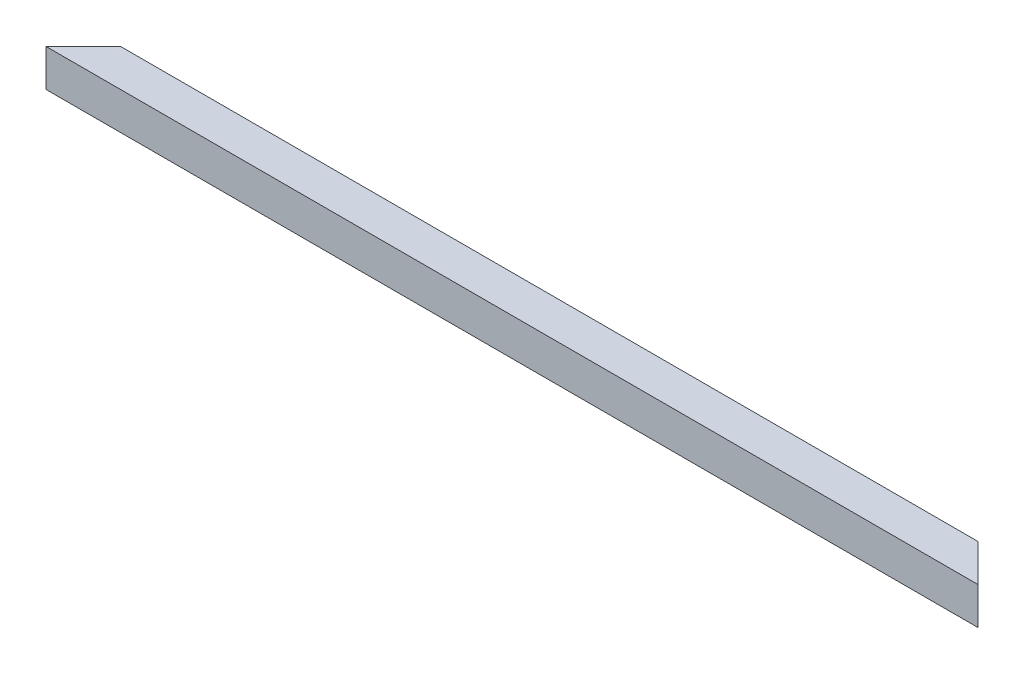
ISO-10303-21;
HEADER;
FILE_DESCRIPTION(('STEP AP214'),'2;1');
FILE_NAME('part.step','',(''),(''),'','','');
FILE_SCHEMA(('AUTOMOTIVE_DESIGN { 1 0 10303 214 1 1 1 1 }'));
ENDSEC;
DATA;
#1=APPLICATION_CONTEXT('core data for automotive mechanical design processes');
#2=APPLICATION_PROTOCOL_DEFINITION('international standard','automotive_design',2000,#1);
#3=PRODUCT_CONTEXT('',#1,'mechanical');
#4=PRODUCT('Part','Part','',(#3));
#5=PRODUCT_RELATED_PRODUCT_CATEGORY('part','',(#4));
#6=PRODUCT_DEFINITION_FORMATION('','',#4);
#7=PRODUCT_DEFINITION_CONTEXT('part definition',#1,'design');
#8=PRODUCT_DEFINITION('design','',#6,#7);
#9=PRODUCT_DEFINITION_SHAPE('','',#8);
#10=(LENGTH_UNIT() NAMED_UNIT(*) SI_UNIT(.MILLI.,.METRE.));
#11=(NAMED_UNIT(*) PLANE_ANGLE_UNIT() SI_UNIT($,.RADIAN.));
#12=(NAMED_UNIT(*) SI_UNIT($,.STERADIAN.) SOLID_ANGLE_UNIT());
#13=UNCERTAINTY_MEASURE_WITH_UNIT(LENGTH_MEASURE(1.E-05),#10,'distance_accuracy_value','');
#14=(GEOMETRIC_REPRESENTATION_CONTEXT(3) GLOBAL_UNCERTAINTY_ASSIGNED_CONTEXT((#13)) GLOBAL_UNIT_ASSIGNED_CONTEXT((#10,
#11,#12)) REPRESENTATION_CONTEXT('',''));
#15=CARTESIAN_POINT('',(0.,0.,0.));
#16=DIRECTION('',(0.,0.,1.));
#17=DIRECTION('',(1.,0.,0.));
#18=AXIS2_PLACEMENT_3D('',#15,#16,#17);
#19=CARTESIAN_POINT('',(1000.,-20.,-20.));
#20=DIRECTION('',(0.,0.,1.));
#21=DIRECTION('',(1.,0.,0.));
#22=AXIS2_PLACEMENT_3D('',#19,#20,#21);
#23=PLANE('',#22);
#24=DIRECTION('',(-1.,0.,0.));
#25=VECTOR('',#24,1.);
#26=CARTESIAN_POINT('',(1000.,20.,-20.));
#27=LINE('',#26,#25);
#28=CARTESIAN_POINT('',(960.,20.,-20.));
#29=VERTEX_POINT('',#28);
#30=CARTESIAN_POINT('',(40.,20.,-20.));
#31=VERTEX_POINT('',#30);
#32=EDGE_CURVE('E108',#29,#31,#27,.T.);
#33=ORIENTED_EDGE('',*,*,#32,.F.);
#34=DIRECTION('',(0.,1.,0.));
#35=VECTOR('',#34,1.);
#36=CARTESIAN_POINT('',(960.,-20.,-20.));
#37=LINE('',#36,#35);
#38=CARTESIAN_POINT('',(960.,-20.,-20.));
#39=VERTEX_POINT('',#38);
#40=EDGE_CURVE('E98',#39,#29,#37,.T.);
#41=ORIENTED_EDGE('',*,*,#40,.F.);
#42=DIRECTION('',(-1.,0.,0.));
#43=VECTOR('',#42,1.);
#44=CARTESIAN_POINT('',(1000.,-20.,-20.));
#45=LINE('',#44,#43);
#46=CARTESIAN_POINT('',(40.0000000000001,-20.,-20.));
#47=VERTEX_POINT('',#46);
#48=EDGE_CURVE('E53',#39,#47,#45,.T.);
#49=ORIENTED_EDGE('',*,*,#48,.T.);
#50=DIRECTION('',(0.,1.,0.));
#51=VECTOR('',#50,1.);
#52=CARTESIAN_POINT('',(40.,-20.,-20.));
#53=LINE('',#52,#51);
#54=EDGE_CURVE('E165',#47,#31,#53,.T.);
#55=ORIENTED_EDGE('',*,*,#54,.T.);
#56=EDGE_LOOP('',(#33,#41,#49,#55));
#57=FACE_BOUND('',#56,.T.);
#58=ADVANCED_FACE('F32',(#57),#23,.F.);
#59=CARTESIAN_POINT('',(1000.,20.,20.));
#60=DIRECTION('',(0.,-1.,0.));
#61=DIRECTION('',(0.,0.,-1.));
#62=AXIS2_PLACEMENT_3D('',#59,#60,#61);
#63=PLANE('',#62);
#64=DIRECTION('',(-1.,0.,0.));
#65=VECTOR('',#64,1.);
#66=CARTESIAN_POINT('',(1000.,20.,20.));
#67=LINE('',#66,#65);
#68=CARTESIAN_POINT('',(1000.,20.,20.));
#69=VERTEX_POINT('',#68);
#70=CARTESIAN_POINT('',(0.,20.,20.));
#71=VERTEX_POINT('',#70);
#72=EDGE_CURVE('E116',#69,#71,#67,.T.);
#73=ORIENTED_EDGE('',*,*,#72,.F.);
#74=DIRECTION('',(0.707106781186547,0.,0.707106781186548));
#75=VECTOR('',#74,1.);
#76=CARTESIAN_POINT('',(1000.,20.,20.));
#77=LINE('',#76,#75);
#78=EDGE_CURVE('E105',#29,#69,#77,.T.);
#79=ORIENTED_EDGE('',*,*,#78,.F.);
#80=ORIENTED_EDGE('',*,*,#32,.T.);
#81=DIRECTION('',(0.707106781186548,0.,-0.707106781186548));
#82=VECTOR('',#81,1.);
#83=CARTESIAN_POINT('',(0.,20.,20.));
#84=LINE('',#83,#82);
#85=EDGE_CURVE('E161',#71,#31,#84,.T.);
#86=ORIENTED_EDGE('',*,*,#85,.F.);
#87=EDGE_LOOP('',(#73,#79,#80,#86));
#88=FACE_BOUND('',#87,.T.);
#89=ADVANCED_FACE('F163',(#88),#63,.F.);
#90=CARTESIAN_POINT('',(1000.,-20.,20.));
#91=DIRECTION('',(0.,0.,-1.));
#92=DIRECTION('',(-1.,0.,0.));
#93=AXIS2_PLACEMENT_3D('',#90,#91,#92);
#94=PLANE('',#93);
#95=DIRECTION('',(0.,-1.,0.));
#96=VECTOR('',#95,1.);
#97=CARTESIAN_POINT('',(0.,-20.,20.));
#98=LINE('',#97,#96);
#99=CARTESIAN_POINT('',(0.,-20.,20.));
#100=VERTEX_POINT('',#99);
#101=EDGE_CURVE('E118',#71,#100,#98,.T.);
#102=ORIENTED_EDGE('',*,*,#101,.T.);
#103=DIRECTION('',(-1.,0.,0.));
#104=VECTOR('',#103,1.);
#105=CARTESIAN_POINT('',(1000.,-20.,20.));
#106=LINE('',#105,#104);
#107=CARTESIAN_POINT('',(1000.,-20.,20.));
#108=VERTEX_POINT('',#107);
#109=EDGE_CURVE('E114',#108,#100,#106,.T.);
#110=ORIENTED_EDGE('',*,*,#109,.F.);
#111=DIRECTION('',(0.,-1.,0.));
#112=VECTOR('',#111,1.);
#113=CARTESIAN_POINT('',(1000.,-20.,20.));
#114=LINE('',#113,#112);
#115=EDGE_CURVE('E101',#69,#108,#114,.T.);
#116=ORIENTED_EDGE('',*,*,#115,.F.);
#117=ORIENTED_EDGE('',*,*,#72,.T.);
#118=EDGE_LOOP('',(#102,#110,#116,#117));
#119=FACE_BOUND('',#118,.T.);
#120=ADVANCED_FACE('F157',(#119),#94,.F.);
#121=CARTESIAN_POINT('',(1000.,-20.,20.));
#122=DIRECTION('',(0.,1.,0.));
#123=DIRECTION('',(0.,0.,1.));
#124=AXIS2_PLACEMENT_3D('',#121,#122,#123);
#125=PLANE('',#124);
#126=ORIENTED_EDGE('',*,*,#48,.F.);
#127=DIRECTION('',(0.707106781186547,0.,0.707106781186548));
#128=VECTOR('',#127,1.);
#129=CARTESIAN_POINT('',(1000.,-20.,20.));
#130=LINE('',#129,#128);
#131=EDGE_CURVE('E96',#39,#108,#130,.T.);
#132=ORIENTED_EDGE('',*,*,#131,.T.);
#133=ORIENTED_EDGE('',*,*,#109,.T.);
#134=DIRECTION('',(0.707106781186548,0.,-0.707106781186548));
#135=VECTOR('',#134,1.);
#136=CARTESIAN_POINT('',(0.,-20.,20.));
#137=LINE('',#136,#135);
#138=EDGE_CURVE('E113',#100,#47,#137,.T.);
#139=ORIENTED_EDGE('',*,*,#138,.T.);
#140=EDGE_LOOP('',(#126,#132,#133,#139));
#141=FACE_BOUND('',#140,.T.);
#142=ADVANCED_FACE('F112',(#141),#125,.F.);
#143=CARTESIAN_POINT('',(1000.,-18.,18.));
#144=DIRECTION('',(0.,0.,-1.));
#145=DIRECTION('',(-1.,0.,0.));
#146=AXIS2_PLACEMENT_3D('',#143,#144,#145);
#147=PLANE('',#146);
#148=DIRECTION('',(0.,1.,0.));
#149=VECTOR('',#148,1.);
#150=CARTESIAN_POINT('',(998.,-18.,18.));
#151=LINE('',#150,#149);
#152=CARTESIAN_POINT('',(998.,-18.,18.));
#153=VERTEX_POINT('',#152);
#154=CARTESIAN_POINT('',(998.,18.,18.));
#155=VERTEX_POINT('',#154);
#156=EDGE_CURVE('E45',#153,#155,#151,.T.);
#157=ORIENTED_EDGE('',*,*,#156,.F.);
#158=DIRECTION('',(-1.,0.,0.));
#159=VECTOR('',#158,1.);
#160=CARTESIAN_POINT('',(1000.,-18.,18.));
#161=LINE('',#160,#159);
#162=CARTESIAN_POINT('',(1.99999999999989,-18.,18.));
#163=VERTEX_POINT('',#162);
#164=EDGE_CURVE('E144',#153,#163,#161,.T.);
#165=ORIENTED_EDGE('',*,*,#164,.T.);
#166=DIRECTION('',(0.,-1.,0.));
#167=VECTOR('',#166,1.);
#168=CARTESIAN_POINT('',(2.00000000000011,-18.,18.));
#169=LINE('',#168,#167);
#170=CARTESIAN_POINT('',(1.99999999999989,18.,18.));
#171=VERTEX_POINT('',#170);
#172=EDGE_CURVE('E133',#171,#163,#169,.T.);
#173=ORIENTED_EDGE('',*,*,#172,.F.);
#174=DIRECTION('',(-1.,0.,0.));
#175=VECTOR('',#174,1.);
#176=CARTESIAN_POINT('',(1000.,18.,18.));
#177=LINE('',#176,#175);
#178=EDGE_CURVE('E142',#155,#171,#177,.T.);
#179=ORIENTED_EDGE('',*,*,#178,.F.);
#180=EDGE_LOOP('',(#157,#165,#173,#179));
#181=FACE_BOUND('',#180,.T.);
#182=ADVANCED_FACE('F141',(#181),#147,.T.);
#183=CARTESIAN_POINT('',(1000.,-18.,-18.));
#184=DIRECTION('',(0.,1.,0.));
#185=DIRECTION('',(0.,0.,1.));
#186=AXIS2_PLACEMENT_3D('',#183,#184,#185);
#187=PLANE('',#186);
#188=DIRECTION('',(0.707106781186547,0.,0.707106781186548));
#189=VECTOR('',#188,1.);
#190=CARTESIAN_POINT('',(981.,-18.,0.999999999999959));
#191=LINE('',#190,#189);
#192=CARTESIAN_POINT('',(962.,-18.,-18.));
#193=VERTEX_POINT('',#192);
#194=EDGE_CURVE('E167',#193,#153,#191,.T.);
#195=ORIENTED_EDGE('',*,*,#194,.F.);
#196=DIRECTION('',(-1.,0.,0.));
#197=VECTOR('',#196,1.);
#198=CARTESIAN_POINT('',(1000.,-18.,-18.));
#199=LINE('',#198,#197);
#200=CARTESIAN_POINT('',(37.9999999999999,-18.,-18.));
#201=VERTEX_POINT('',#200);
#202=EDGE_CURVE('E153',#193,#201,#199,.T.);
#203=ORIENTED_EDGE('',*,*,#202,.T.);
#204=DIRECTION('',(0.707106781186548,0.,-0.707106781186548));
#205=VECTOR('',#204,1.);
#206=CARTESIAN_POINT('',(519.,-18.,-499.));
#207=LINE('',#206,#205);
#208=EDGE_CURVE('E145',#163,#201,#207,.T.);
#209=ORIENTED_EDGE('',*,*,#208,.F.);
#210=ORIENTED_EDGE('',*,*,#164,.F.);
#211=EDGE_LOOP('',(#195,#203,#209,#210));
#212=FACE_BOUND('',#211,.T.);
#213=ADVANCED_FACE('F178',(#212),#187,.T.);
#214=CARTESIAN_POINT('',(1000.,-18.,-18.));
#215=DIRECTION('',(0.,0.,1.));
#216=DIRECTION('',(1.,0.,0.));
#217=AXIS2_PLACEMENT_3D('',#214,#215,#216);
#218=PLANE('',#217);
#219=DIRECTION('',(0.,-1.,0.));
#220=VECTOR('',#219,1.);
#221=CARTESIAN_POINT('',(962.,-18.,-18.));
#222=LINE('',#221,#220);
#223=CARTESIAN_POINT('',(962.,18.,-18.));
#224=VERTEX_POINT('',#223);
#225=EDGE_CURVE('E109',#224,#193,#222,.T.);
#226=ORIENTED_EDGE('',*,*,#225,.F.);
#227=DIRECTION('',(-1.,0.,0.));
#228=VECTOR('',#227,1.);
#229=CARTESIAN_POINT('',(1000.,18.,-18.));
#230=LINE('',#229,#228);
#231=CARTESIAN_POINT('',(38.0000000000001,18.,-18.0000000000001));
#232=VERTEX_POINT('',#231);
#233=EDGE_CURVE('E147',#224,#232,#230,.T.);
#234=ORIENTED_EDGE('',*,*,#233,.T.);
#235=DIRECTION('',(0.,1.,0.));
#236=VECTOR('',#235,1.);
#237=CARTESIAN_POINT('',(37.9999999999999,-18.,-18.));
#238=LINE('',#237,#236);
#239=EDGE_CURVE('E136',#201,#232,#238,.T.);
#240=ORIENTED_EDGE('',*,*,#239,.F.);
#241=ORIENTED_EDGE('',*,*,#202,.F.);
#242=EDGE_LOOP('',(#226,#234,#240,#241));
#243=FACE_BOUND('',#242,.T.);
#244=ADVANCED_FACE('F179',(#243),#218,.T.);
#245=CARTESIAN_POINT('',(1000.,18.,-18.));
#246=DIRECTION('',(0.,-1.,0.));
#247=DIRECTION('',(0.,0.,-1.));
#248=AXIS2_PLACEMENT_3D('',#245,#246,#247);
#249=PLANE('',#248);
#250=DIRECTION('',(-0.707106781186547,0.,-0.707106781186548));
#251=VECTOR('',#250,1.);
#252=CARTESIAN_POINT('',(981.,18.,0.999999999999959));
#253=LINE('',#252,#251);
#254=EDGE_CURVE('E11',#155,#224,#253,.T.);
#255=ORIENTED_EDGE('',*,*,#254,.F.);
#256=ORIENTED_EDGE('',*,*,#178,.T.);
#257=DIRECTION('',(-0.707106781186548,0.,0.707106781186548));
#258=VECTOR('',#257,1.);
#259=CARTESIAN_POINT('',(519.,18.,-499.));
#260=LINE('',#259,#258);
#261=EDGE_CURVE('E39',#232,#171,#260,.T.);
#262=ORIENTED_EDGE('',*,*,#261,.F.);
#263=ORIENTED_EDGE('',*,*,#233,.F.);
#264=EDGE_LOOP('',(#255,#256,#262,#263));
#265=FACE_BOUND('',#264,.T.);
#266=ADVANCED_FACE('F180',(#265),#249,.T.);
#267=CARTESIAN_POINT('',(0.,-20.,20.));
#268=DIRECTION('',(0.707106781186548,0.,0.707106781186548));
#269=DIRECTION('',(0.707106781186548,0.,-0.707106781186548));
#270=AXIS2_PLACEMENT_3D('',#267,#268,#269);
#271=PLANE('',#270);
#272=ORIENTED_EDGE('',*,*,#172,.T.);
#273=ORIENTED_EDGE('',*,*,#208,.T.);
#274=ORIENTED_EDGE('',*,*,#239,.T.);
#275=ORIENTED_EDGE('',*,*,#261,.T.);
#276=EDGE_LOOP('',(#272,#273,#274,#275));
#277=FACE_BOUND('',#276,.T.);
#278=ORIENTED_EDGE('',*,*,#85,.T.);
#279=ORIENTED_EDGE('',*,*,#54,.F.);
#280=ORIENTED_EDGE('',*,*,#138,.F.);
#281=ORIENTED_EDGE('',*,*,#101,.F.);
#282=EDGE_LOOP('',(#278,#279,#280,#281));
#283=FACE_BOUND('',#282,.T.);
#284=ADVANCED_FACE('F130',(#277,#283),#271,.F.);
#285=CARTESIAN_POINT('',(1000.,-20.,20.));
#286=DIRECTION('',(-0.707106781186548,0.,0.707106781186547));
#287=DIRECTION('',(0.707106781186547,0.,0.707106781186548));
#288=AXIS2_PLACEMENT_3D('',#285,#286,#287);
#289=PLANE('',#288);
#290=ORIENTED_EDGE('',*,*,#156,.T.);
#291=ORIENTED_EDGE('',*,*,#254,.T.);
#292=ORIENTED_EDGE('',*,*,#225,.T.);
#293=ORIENTED_EDGE('',*,*,#194,.T.);
#294=EDGE_LOOP('',(#290,#291,#292,#293));
#295=FACE_BOUND('',#294,.T.);
#296=ORIENTED_EDGE('',*,*,#78,.T.);
#297=ORIENTED_EDGE('',*,*,#115,.T.);
#298=ORIENTED_EDGE('',*,*,#131,.F.);
#299=ORIENTED_EDGE('',*,*,#40,.T.);
#300=EDGE_LOOP('',(#296,#297,#298,#299));
#301=FACE_BOUND('',#300,.T.);
#302=ADVANCED_FACE('F97',(#295,#301),#289,.F.);
#303=CLOSED_SHELL('',(#58,#89,#120,#142,#182,#213,#244,#266,#284,#302));
#304=MANIFOLD_SOLID_BREP('B2',#303);
#305=ADVANCED_BREP_SHAPE_REPRESENTATION('',(#18,#304),#14);
#306=SHAPE_DEFINITION_REPRESENTATION(#9,#305);
ENDSEC;
END-ISO-10303-21;
